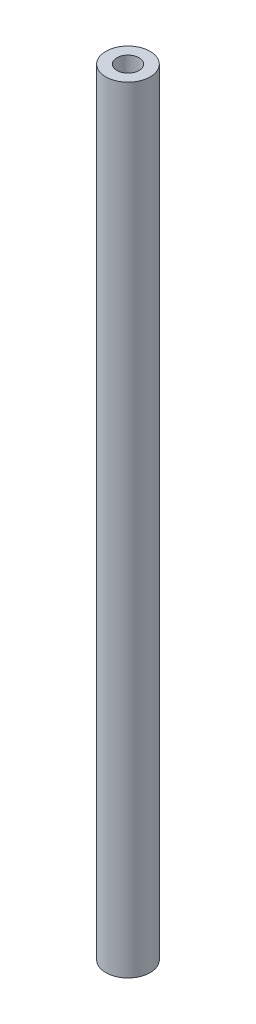
ISO-10303-21;
HEADER;
FILE_DESCRIPTION(('STEP AP214'),'2;1');
FILE_NAME('part.step','',(''),(''),'','','');
FILE_SCHEMA(('AUTOMOTIVE_DESIGN { 1 0 10303 214 1 1 1 1 }'));
ENDSEC;
DATA;
#1=APPLICATION_CONTEXT('core data for automotive mechanical design processes');
#2=APPLICATION_PROTOCOL_DEFINITION('international standard','automotive_design',2000,#1);
#3=PRODUCT_CONTEXT('',#1,'mechanical');
#4=PRODUCT('Part','Part','',(#3));
#5=PRODUCT_RELATED_PRODUCT_CATEGORY('part','',(#4));
#6=PRODUCT_DEFINITION_FORMATION('','',#4);
#7=PRODUCT_DEFINITION_CONTEXT('part definition',#1,'design');
#8=PRODUCT_DEFINITION('design','',#6,#7);
#9=PRODUCT_DEFINITION_SHAPE('','',#8);
#10=(LENGTH_UNIT() NAMED_UNIT(*) SI_UNIT(.MILLI.,.METRE.));
#11=(NAMED_UNIT(*) PLANE_ANGLE_UNIT() SI_UNIT($,.RADIAN.));
#12=(NAMED_UNIT(*) SI_UNIT($,.STERADIAN.) SOLID_ANGLE_UNIT());
#13=UNCERTAINTY_MEASURE_WITH_UNIT(LENGTH_MEASURE(1.E-05),#10,'distance_accuracy_value','');
#14=(GEOMETRIC_REPRESENTATION_CONTEXT(3) GLOBAL_UNCERTAINTY_ASSIGNED_CONTEXT((#13)) GLOBAL_UNIT_ASSIGNED_CONTEXT((#10,
#11,#12)) REPRESENTATION_CONTEXT('',''));
#15=CARTESIAN_POINT('',(0.,0.,0.));
#16=DIRECTION('',(0.,0.,1.));
#17=DIRECTION('',(1.,0.,0.));
#18=AXIS2_PLACEMENT_3D('',#15,#16,#17);
#19=CARTESIAN_POINT('',(0.,175.,0.));
#20=DIRECTION('',(0.,-1.,0.));
#21=DIRECTION('',(0.,0.,-1.));
#22=AXIS2_PLACEMENT_3D('',#19,#20,#21);
#23=CYLINDRICAL_SURFACE('',#22,5.);
#24=CARTESIAN_POINT('',(0.,175.,0.));
#25=DIRECTION('',(0.,1.,0.));
#26=DIRECTION('',(0.,0.,1.));
#27=AXIS2_PLACEMENT_3D('',#24,#25,#26);
#28=CIRCLE('',#27,5.);
#29=CARTESIAN_POINT('',(0.,175.,5.));
#30=VERTEX_POINT('',#29);
#31=EDGE_CURVE('E11',#30,#30,#28,.T.);
#32=ORIENTED_EDGE('',*,*,#31,.F.);
#33=EDGE_LOOP('',(#32));
#34=FACE_BOUND('',#33,.T.);
#35=CARTESIAN_POINT('',(0.,0.,0.));
#36=DIRECTION('',(0.,1.,0.));
#37=DIRECTION('',(0.,0.,1.));
#38=AXIS2_PLACEMENT_3D('',#35,#36,#37);
#39=CIRCLE('',#38,5.);
#40=CARTESIAN_POINT('',(0.,0.,5.));
#41=VERTEX_POINT('',#40);
#42=EDGE_CURVE('E45',#41,#41,#39,.T.);
#43=ORIENTED_EDGE('',*,*,#42,.T.);
#44=EDGE_LOOP('',(#43));
#45=FACE_BOUND('',#44,.T.);
#46=ADVANCED_FACE('F42',(#34,#45),#23,.T.);
#47=CARTESIAN_POINT('',(0.,175.,0.));
#48=DIRECTION('',(0.,1.,0.));
#49=DIRECTION('',(0.,0.,1.));
#50=AXIS2_PLACEMENT_3D('',#47,#48,#49);
#51=PLANE('',#50);
#52=CARTESIAN_POINT('',(0.,175.,0.));
#53=DIRECTION('',(0.,1.,0.));
#54=DIRECTION('',(0.,0.,1.));
#55=AXIS2_PLACEMENT_3D('',#52,#53,#54);
#56=CIRCLE('',#55,2.5);
#57=CARTESIAN_POINT('',(0.,175.,2.5));
#58=VERTEX_POINT('',#57);
#59=EDGE_CURVE('E65',#58,#58,#56,.T.);
#60=ORIENTED_EDGE('',*,*,#59,.F.);
#61=EDGE_LOOP('',(#60));
#62=FACE_BOUND('',#61,.T.);
#63=ORIENTED_EDGE('',*,*,#31,.T.);
#64=EDGE_LOOP('',(#63));
#65=FACE_BOUND('',#64,.T.);
#66=ADVANCED_FACE('F84',(#62,#65),#51,.T.);
#67=CARTESIAN_POINT('',(0.,0.,0.));
#68=DIRECTION('',(0.,1.,0.));
#69=DIRECTION('',(0.,0.,1.));
#70=AXIS2_PLACEMENT_3D('',#67,#68,#69);
#71=PLANE('',#70);
#72=CARTESIAN_POINT('',(0.,0.,0.));
#73=DIRECTION('',(0.,-1.,0.));
#74=DIRECTION('',(0.,0.,-1.));
#75=AXIS2_PLACEMENT_3D('',#72,#73,#74);
#76=CIRCLE('',#75,2.49999999999999);
#77=CARTESIAN_POINT('',(0.,0.,-2.49999999999999));
#78=VERTEX_POINT('',#77);
#79=EDGE_CURVE('E66',#78,#78,#76,.T.);
#80=ORIENTED_EDGE('',*,*,#79,.F.);
#81=EDGE_LOOP('',(#80));
#82=FACE_BOUND('',#81,.T.);
#83=ORIENTED_EDGE('',*,*,#42,.F.);
#84=EDGE_LOOP('',(#83));
#85=FACE_BOUND('',#84,.T.);
#86=ADVANCED_FACE('F81',(#82,#85),#71,.F.);
#87=CARTESIAN_POINT('',(0.,159.,0.));
#88=DIRECTION('',(0.,1.,0.));
#89=DIRECTION('',(0.,0.,1.));
#90=AXIS2_PLACEMENT_3D('',#87,#88,#89);
#91=CONICAL_SURFACE('',#90,2.5,1.02974425867666);
#92=CARTESIAN_POINT('',(0.,157.497848452431,0.));
#93=VERTEX_POINT('',#92);
#94=VERTEX_LOOP('',#93);
#95=FACE_BOUND('',#94,.T.);
#96=CARTESIAN_POINT('',(0.,159.,0.));
#97=DIRECTION('',(0.,1.,0.));
#98=DIRECTION('',(0.,0.,1.));
#99=AXIS2_PLACEMENT_3D('',#96,#97,#98);
#100=CIRCLE('',#99,2.5);
#101=CARTESIAN_POINT('',(0.,159.,2.5));
#102=VERTEX_POINT('',#101);
#103=EDGE_CURVE('E69',#102,#102,#100,.T.);
#104=ORIENTED_EDGE('',*,*,#103,.T.);
#105=EDGE_LOOP('',(#104));
#106=FACE_BOUND('',#105,.T.);
#107=ADVANCED_FACE('F83',(#95,#106),#91,.F.);
#108=CARTESIAN_POINT('',(0.,175.,0.));
#109=DIRECTION('',(0.,1.,0.));
#110=DIRECTION('',(0.,0.,1.));
#111=AXIS2_PLACEMENT_3D('',#108,#109,#110);
#112=CYLINDRICAL_SURFACE('',#111,2.5);
#113=ORIENTED_EDGE('',*,*,#103,.F.);
#114=EDGE_LOOP('',(#113));
#115=FACE_BOUND('',#114,.T.);
#116=ORIENTED_EDGE('',*,*,#59,.T.);
#117=EDGE_LOOP('',(#116));
#118=FACE_BOUND('',#117,.T.);
#119=ADVANCED_FACE('F59',(#115,#118),#112,.F.);
#120=CARTESIAN_POINT('',(0.,16.,0.));
#121=DIRECTION('',(0.,-1.,0.));
#122=DIRECTION('',(0.,0.,-1.));
#123=AXIS2_PLACEMENT_3D('',#120,#121,#122);
#124=CONICAL_SURFACE('',#123,2.49999999999999,1.02974425867665);
#125=CARTESIAN_POINT('',(0.,17.5021515475689,0.));
#126=VERTEX_POINT('',#125);
#127=VERTEX_LOOP('',#126);
#128=FACE_BOUND('',#127,.T.);
#129=CARTESIAN_POINT('',(0.,16.,0.));
#130=DIRECTION('',(0.,-1.,0.));
#131=DIRECTION('',(0.,0.,-1.));
#132=AXIS2_PLACEMENT_3D('',#129,#130,#131);
#133=CIRCLE('',#132,2.49999999999999);
#134=CARTESIAN_POINT('',(0.,16.,-2.49999999999999));
#135=VERTEX_POINT('',#134);
#136=EDGE_CURVE('E63',#135,#135,#133,.T.);
#137=ORIENTED_EDGE('',*,*,#136,.T.);
#138=EDGE_LOOP('',(#137));
#139=FACE_BOUND('',#138,.T.);
#140=ADVANCED_FACE('F55',(#128,#139),#124,.F.);
#141=CARTESIAN_POINT('',(0.,0.,0.));
#142=DIRECTION('',(0.,-1.,0.));
#143=DIRECTION('',(0.,0.,-1.));
#144=AXIS2_PLACEMENT_3D('',#141,#142,#143);
#145=CYLINDRICAL_SURFACE('',#144,2.49999999999999);
#146=ORIENTED_EDGE('',*,*,#136,.F.);
#147=EDGE_LOOP('',(#146));
#148=FACE_BOUND('',#147,.T.);
#149=ORIENTED_EDGE('',*,*,#79,.T.);
#150=EDGE_LOOP('',(#149));
#151=FACE_BOUND('',#150,.T.);
#152=ADVANCED_FACE('F58',(#148,#151),#145,.F.);
#153=CLOSED_SHELL('',(#46,#66,#86,#107,#119,#140,#152));
#154=MANIFOLD_SOLID_BREP('B2',#153);
#155=ADVANCED_BREP_SHAPE_REPRESENTATION('',(#18,#154),#14);
#156=SHAPE_DEFINITION_REPRESENTATION(#9,#155);
ENDSEC;
END-ISO-10303-21;
